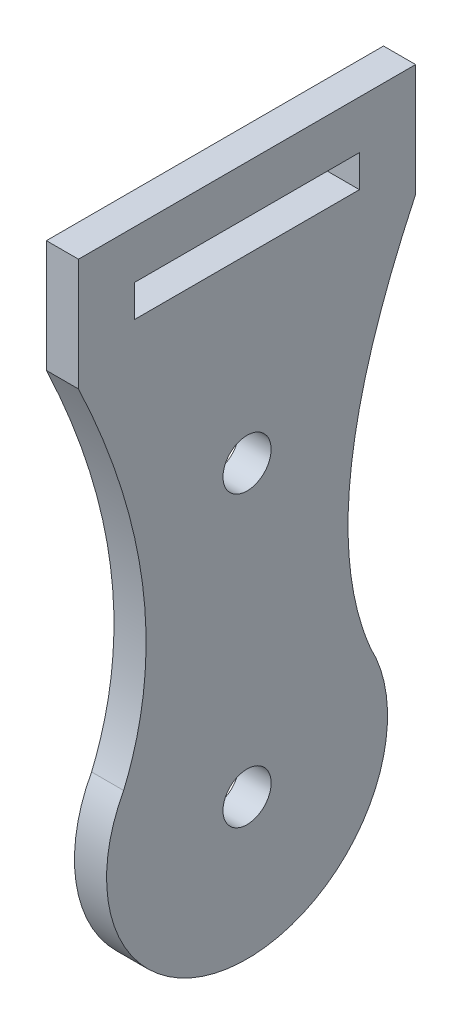
ISO-10303-21;
HEADER;
FILE_DESCRIPTION(('STEP AP214'),'2;1');
FILE_NAME('part.step','',(''),(''),'','','');
FILE_SCHEMA(('AUTOMOTIVE_DESIGN { 1 0 10303 214 1 1 1 1 }'));
ENDSEC;
DATA;
#1=APPLICATION_CONTEXT('core data for automotive mechanical design processes');
#2=APPLICATION_PROTOCOL_DEFINITION('international standard','automotive_design',2000,#1);
#3=PRODUCT_CONTEXT('',#1,'mechanical');
#4=PRODUCT('Part','Part','',(#3));
#5=PRODUCT_RELATED_PRODUCT_CATEGORY('part','',(#4));
#6=PRODUCT_DEFINITION_FORMATION('','',#4);
#7=PRODUCT_DEFINITION_CONTEXT('part definition',#1,'design');
#8=PRODUCT_DEFINITION('design','',#6,#7);
#9=PRODUCT_DEFINITION_SHAPE('','',#8);
#10=(LENGTH_UNIT() NAMED_UNIT(*) SI_UNIT(.MILLI.,.METRE.));
#11=(NAMED_UNIT(*) PLANE_ANGLE_UNIT() SI_UNIT($,.RADIAN.));
#12=(NAMED_UNIT(*) SI_UNIT($,.STERADIAN.) SOLID_ANGLE_UNIT());
#13=UNCERTAINTY_MEASURE_WITH_UNIT(LENGTH_MEASURE(1.E-05),#10,'distance_accuracy_value','');
#14=(GEOMETRIC_REPRESENTATION_CONTEXT(3) GLOBAL_UNCERTAINTY_ASSIGNED_CONTEXT((#13)) GLOBAL_UNIT_ASSIGNED_CONTEXT((#10,
#11,#12)) REPRESENTATION_CONTEXT('',''));
#15=CARTESIAN_POINT('',(0.,0.,0.));
#16=DIRECTION('',(0.,0.,1.));
#17=DIRECTION('',(1.,0.,0.));
#18=AXIS2_PLACEMENT_3D('',#15,#16,#17);
#19=CARTESIAN_POINT('',(2.,27.25,10.5));
#20=CARTESIAN_POINT('',(2.,13.2513662512649,3.86504806560417));
#21=CARTESIAN_POINT('',(2.,4.18403707499627,7.68481188807225));
#22=B_SPLINE_CURVE_WITH_KNOTS('',2,(#19,#20,#21),.UNSPECIFIED.,.F.,.F.,(3,3),(0.,
0.912495845409906),.UNSPECIFIED.);
#23=DIRECTION('',(-1.,0.,0.));
#24=VECTOR('',#23,1.);
#25=SURFACE_OF_LINEAR_EXTRUSION('',#22,#24);
#26=CARTESIAN_POINT('',(0.,27.25,10.5));
#27=CARTESIAN_POINT('',(0.,13.2513662512649,3.86504806560417));
#28=CARTESIAN_POINT('',(0.,4.18403707499627,7.68481188807225));
#29=B_SPLINE_CURVE_WITH_KNOTS('',2,(#26,#27,#28),.UNSPECIFIED.,.F.,.F.,(3,3),(0.,
0.912495845409906),.UNSPECIFIED.);
#30=CARTESIAN_POINT('',(0.,27.25,10.5));
#31=VERTEX_POINT('',#30);
#32=CARTESIAN_POINT('',(0.,4.18403707499627,7.68481188807225));
#33=VERTEX_POINT('',#32);
#34=EDGE_CURVE('E204',#31,#33,#29,.T.);
#35=ORIENTED_EDGE('',*,*,#34,.T.);
#36=DIRECTION('',(-1.,0.,0.));
#37=VECTOR('',#36,1.);
#38=CARTESIAN_POINT('',(2.,4.18403707499627,7.68481188807225));
#39=LINE('',#38,#37);
#40=CARTESIAN_POINT('',(2.,4.18403707499627,7.68481188807225));
#41=VERTEX_POINT('',#40);
#42=EDGE_CURVE('E11',#41,#33,#39,.T.);
#43=ORIENTED_EDGE('',*,*,#42,.F.);
#44=CARTESIAN_POINT('',(2.,27.25,10.5));
#45=VERTEX_POINT('',#44);
#46=EDGE_CURVE('E222',#45,#41,#22,.T.);
#47=ORIENTED_EDGE('',*,*,#46,.F.);
#48=DIRECTION('',(-1.,0.,0.));
#49=VECTOR('',#48,1.);
#50=CARTESIAN_POINT('',(2.,27.25,10.5));
#51=LINE('',#50,#49);
#52=EDGE_CURVE('E238',#45,#31,#51,.T.);
#53=ORIENTED_EDGE('',*,*,#52,.T.);
#54=EDGE_LOOP('',(#35,#43,#47,#53));
#55=FACE_BOUND('',#54,.T.);
#56=ADVANCED_FACE('F36',(#55),#25,.F.);
#57=CARTESIAN_POINT('',(2.,0.,0.));
#58=DIRECTION('',(-1.,0.,0.));
#59=DIRECTION('',(0.,0.,1.));
#60=AXIS2_PLACEMENT_3D('',#57,#58,#59);
#61=CYLINDRICAL_SURFACE('',#60,8.75);
#62=CARTESIAN_POINT('',(0.,0.,0.));
#63=DIRECTION('',(1.,0.,0.));
#64=DIRECTION('',(0.,0.,-1.));
#65=AXIS2_PLACEMENT_3D('',#62,#63,#64);
#66=CIRCLE('',#65,8.75);
#67=CARTESIAN_POINT('',(0.,4.18403707499627,-7.68481188807225));
#68=VERTEX_POINT('',#67);
#69=EDGE_CURVE('E196',#33,#68,#66,.T.);
#70=ORIENTED_EDGE('',*,*,#69,.T.);
#71=DIRECTION('',(-1.,0.,0.));
#72=VECTOR('',#71,1.);
#73=CARTESIAN_POINT('',(2.,4.18403707499627,-7.68481188807225));
#74=LINE('',#73,#72);
#75=CARTESIAN_POINT('',(2.,4.18403707499627,-7.68481188807225));
#76=VERTEX_POINT('',#75);
#77=EDGE_CURVE('E198',#76,#68,#74,.T.);
#78=ORIENTED_EDGE('',*,*,#77,.F.);
#79=CARTESIAN_POINT('',(2.,0.,0.));
#80=DIRECTION('',(1.,0.,0.));
#81=DIRECTION('',(0.,0.,-1.));
#82=AXIS2_PLACEMENT_3D('',#79,#80,#81);
#83=CIRCLE('',#82,8.75);
#84=EDGE_CURVE('E228',#41,#76,#83,.T.);
#85=ORIENTED_EDGE('',*,*,#84,.F.);
#86=ORIENTED_EDGE('',*,*,#42,.T.);
#87=EDGE_LOOP('',(#70,#78,#85,#86));
#88=FACE_BOUND('',#87,.T.);
#89=ADVANCED_FACE('F187',(#88),#61,.T.);
#90=CARTESIAN_POINT('',(2.,34.25,10.5));
#91=DIRECTION('',(0.,-1.,0.));
#92=DIRECTION('',(0.,0.,-1.));
#93=AXIS2_PLACEMENT_3D('',#90,#91,#92);
#94=PLANE('',#93);
#95=DIRECTION('',(0.,0.,1.));
#96=VECTOR('',#95,1.);
#97=CARTESIAN_POINT('',(0.,34.25,10.5));
#98=LINE('',#97,#96);
#99=CARTESIAN_POINT('',(0.,34.25,-10.5));
#100=VERTEX_POINT('',#99);
#101=CARTESIAN_POINT('',(0.,34.25,10.5));
#102=VERTEX_POINT('',#101);
#103=EDGE_CURVE('E203',#100,#102,#98,.T.);
#104=ORIENTED_EDGE('',*,*,#103,.T.);
#105=DIRECTION('',(-1.,0.,0.));
#106=VECTOR('',#105,1.);
#107=CARTESIAN_POINT('',(2.,34.25,10.5));
#108=LINE('',#107,#106);
#109=CARTESIAN_POINT('',(2.,34.25,10.5));
#110=VERTEX_POINT('',#109);
#111=EDGE_CURVE('E44',#110,#102,#108,.T.);
#112=ORIENTED_EDGE('',*,*,#111,.F.);
#113=DIRECTION('',(0.,0.,1.));
#114=VECTOR('',#113,1.);
#115=CARTESIAN_POINT('',(2.,34.25,10.5));
#116=LINE('',#115,#114);
#117=CARTESIAN_POINT('',(2.,34.25,-10.5));
#118=VERTEX_POINT('',#117);
#119=EDGE_CURVE('E234',#118,#110,#116,.T.);
#120=ORIENTED_EDGE('',*,*,#119,.F.);
#121=DIRECTION('',(-1.,0.,0.));
#122=VECTOR('',#121,1.);
#123=CARTESIAN_POINT('',(2.,34.25,-10.5));
#124=LINE('',#123,#122);
#125=EDGE_CURVE('E209',#118,#100,#124,.T.);
#126=ORIENTED_EDGE('',*,*,#125,.T.);
#127=EDGE_LOOP('',(#104,#112,#120,#126));
#128=FACE_BOUND('',#127,.T.);
#129=ADVANCED_FACE('F184',(#128),#94,.F.);
#130=CARTESIAN_POINT('',(2.,34.25,10.5));
#131=DIRECTION('',(0.,0.,-1.));
#132=DIRECTION('',(0.,1.,0.));
#133=AXIS2_PLACEMENT_3D('',#130,#131,#132);
#134=PLANE('',#133);
#135=DIRECTION('',(0.,-1.,0.));
#136=VECTOR('',#135,1.);
#137=CARTESIAN_POINT('',(0.,34.25,10.5));
#138=LINE('',#137,#136);
#139=EDGE_CURVE('E229',#102,#31,#138,.T.);
#140=ORIENTED_EDGE('',*,*,#139,.T.);
#141=ORIENTED_EDGE('',*,*,#52,.F.);
#142=DIRECTION('',(0.,-1.,0.));
#143=VECTOR('',#142,1.);
#144=CARTESIAN_POINT('',(2.,34.25,10.5));
#145=LINE('',#144,#143);
#146=EDGE_CURVE('E236',#110,#45,#145,.T.);
#147=ORIENTED_EDGE('',*,*,#146,.F.);
#148=ORIENTED_EDGE('',*,*,#111,.T.);
#149=EDGE_LOOP('',(#140,#141,#147,#148));
#150=FACE_BOUND('',#149,.T.);
#151=ADVANCED_FACE('F177',(#150),#134,.F.);
#152=CARTESIAN_POINT('',(2.,14.4841923943815,6.47872700482015));
#153=DIRECTION('',(1.,0.,0.));
#154=DIRECTION('',(0.,0.,-1.));
#155=AXIS2_PLACEMENT_3D('',#152,#153,#154);
#156=PLANE('',#155);
#157=CARTESIAN_POINT('',(2.,0.,0.));
#158=DIRECTION('',(1.,0.,0.));
#159=DIRECTION('',(0.,0.,-1.));
#160=AXIS2_PLACEMENT_3D('',#157,#158,#159);
#161=CIRCLE('',#160,1.5);
#162=CARTESIAN_POINT('',(2.,0.,-1.5));
#163=VERTEX_POINT('',#162);
#164=EDGE_CURVE('E290',#163,#163,#161,.T.);
#165=ORIENTED_EDGE('',*,*,#164,.F.);
#166=EDGE_LOOP('',(#165));
#167=FACE_BOUND('',#166,.T.);
#168=CARTESIAN_POINT('',(2.,18.,0.));
#169=DIRECTION('',(1.,0.,0.));
#170=DIRECTION('',(0.,0.,-1.));
#171=AXIS2_PLACEMENT_3D('',#168,#169,#170);
#172=CIRCLE('',#171,1.5);
#173=CARTESIAN_POINT('',(2.,18.,-1.5));
#174=VERTEX_POINT('',#173);
#175=EDGE_CURVE('E137',#174,#174,#172,.T.);
#176=ORIENTED_EDGE('',*,*,#175,.F.);
#177=EDGE_LOOP('',(#176));
#178=FACE_BOUND('',#177,.T.);
#179=DIRECTION('',(0.,1.,0.));
#180=VECTOR('',#179,1.);
#181=CARTESIAN_POINT('',(2.,31.25,-7.));
#182=LINE('',#181,#180);
#183=CARTESIAN_POINT('',(2.,29.25,-7.));
#184=VERTEX_POINT('',#183);
#185=CARTESIAN_POINT('',(2.,31.25,-7.));
#186=VERTEX_POINT('',#185);
#187=EDGE_CURVE('E51',#184,#186,#182,.T.);
#188=ORIENTED_EDGE('',*,*,#187,.F.);
#189=DIRECTION('',(0.,0.,-1.));
#190=VECTOR('',#189,1.);
#191=CARTESIAN_POINT('',(2.,29.25,7.));
#192=LINE('',#191,#190);
#193=CARTESIAN_POINT('',(2.,29.25,7.));
#194=VERTEX_POINT('',#193);
#195=EDGE_CURVE('E131',#194,#184,#192,.T.);
#196=ORIENTED_EDGE('',*,*,#195,.F.);
#197=DIRECTION('',(0.,-1.,0.));
#198=VECTOR('',#197,1.);
#199=CARTESIAN_POINT('',(2.,31.25,7.));
#200=LINE('',#199,#198);
#201=CARTESIAN_POINT('',(2.,31.25,7.));
#202=VERTEX_POINT('',#201);
#203=EDGE_CURVE('E134',#202,#194,#200,.T.);
#204=ORIENTED_EDGE('',*,*,#203,.F.);
#205=DIRECTION('',(0.,0.,1.));
#206=VECTOR('',#205,1.);
#207=CARTESIAN_POINT('',(2.,31.25,7.));
#208=LINE('',#207,#206);
#209=EDGE_CURVE('E143',#186,#202,#208,.T.);
#210=ORIENTED_EDGE('',*,*,#209,.F.);
#211=EDGE_LOOP('',(#188,#196,#204,#210));
#212=FACE_BOUND('',#211,.T.);
#213=ORIENTED_EDGE('',*,*,#46,.T.);
#214=ORIENTED_EDGE('',*,*,#84,.T.);
#215=CARTESIAN_POINT('',(2.,27.25,-10.5));
#216=CARTESIAN_POINT('',(2.,13.2513662512649,-3.86504806560417));
#217=CARTESIAN_POINT('',(2.,4.18403707499627,-7.68481188807225));
#218=B_SPLINE_CURVE_WITH_KNOTS('',2,(#215,#216,#217),.UNSPECIFIED.,.F.,.F.,(3,3),(0.,
0.912495845409906),.UNSPECIFIED.);
#219=CARTESIAN_POINT('',(2.,27.25,-10.5));
#220=VERTEX_POINT('',#219);
#221=EDGE_CURVE('E154',#220,#76,#218,.T.);
#222=ORIENTED_EDGE('',*,*,#221,.F.);
#223=DIRECTION('',(0.,-1.,0.));
#224=VECTOR('',#223,1.);
#225=CARTESIAN_POINT('',(2.,34.25,-10.5));
#226=LINE('',#225,#224);
#227=EDGE_CURVE('E160',#118,#220,#226,.T.);
#228=ORIENTED_EDGE('',*,*,#227,.F.);
#229=ORIENTED_EDGE('',*,*,#119,.T.);
#230=ORIENTED_EDGE('',*,*,#146,.T.);
#231=EDGE_LOOP('',(#213,#214,#222,#228,#229,#230));
#232=FACE_BOUND('',#231,.T.);
#233=ADVANCED_FACE('F174',(#167,#178,#212,#232),#156,.T.);
#234=CARTESIAN_POINT('',(0.,14.4841923943815,6.47872700482015));
#235=DIRECTION('',(1.,0.,0.));
#236=DIRECTION('',(0.,0.,-1.));
#237=AXIS2_PLACEMENT_3D('',#234,#235,#236);
#238=PLANE('',#237);
#239=CARTESIAN_POINT('',(0.,0.,0.));
#240=DIRECTION('',(1.,0.,0.));
#241=DIRECTION('',(0.,0.,-1.));
#242=AXIS2_PLACEMENT_3D('',#239,#240,#241);
#243=CIRCLE('',#242,1.5);
#244=CARTESIAN_POINT('',(0.,0.,-1.5));
#245=VERTEX_POINT('',#244);
#246=EDGE_CURVE('E287',#245,#245,#243,.T.);
#247=ORIENTED_EDGE('',*,*,#246,.T.);
#248=EDGE_LOOP('',(#247));
#249=FACE_BOUND('',#248,.T.);
#250=CARTESIAN_POINT('',(0.,18.,0.));
#251=DIRECTION('',(1.,0.,0.));
#252=DIRECTION('',(0.,0.,-1.));
#253=AXIS2_PLACEMENT_3D('',#250,#251,#252);
#254=CIRCLE('',#253,1.5);
#255=CARTESIAN_POINT('',(0.,18.,-1.5));
#256=VERTEX_POINT('',#255);
#257=EDGE_CURVE('E144',#256,#256,#254,.T.);
#258=ORIENTED_EDGE('',*,*,#257,.T.);
#259=EDGE_LOOP('',(#258));
#260=FACE_BOUND('',#259,.T.);
#261=DIRECTION('',(0.,0.,-1.));
#262=VECTOR('',#261,1.);
#263=CARTESIAN_POINT('',(0.,29.25,7.));
#264=LINE('',#263,#262);
#265=CARTESIAN_POINT('',(0.,29.25,7.));
#266=VERTEX_POINT('',#265);
#267=CARTESIAN_POINT('',(0.,29.25,-7.));
#268=VERTEX_POINT('',#267);
#269=EDGE_CURVE('E121',#266,#268,#264,.T.);
#270=ORIENTED_EDGE('',*,*,#269,.T.);
#271=DIRECTION('',(0.,1.,0.));
#272=VECTOR('',#271,1.);
#273=CARTESIAN_POINT('',(0.,31.25,-7.));
#274=LINE('',#273,#272);
#275=CARTESIAN_POINT('',(0.,31.25,-7.));
#276=VERTEX_POINT('',#275);
#277=EDGE_CURVE('E115',#268,#276,#274,.T.);
#278=ORIENTED_EDGE('',*,*,#277,.T.);
#279=DIRECTION('',(0.,0.,1.));
#280=VECTOR('',#279,1.);
#281=CARTESIAN_POINT('',(0.,31.25,7.));
#282=LINE('',#281,#280);
#283=CARTESIAN_POINT('',(0.,31.25,7.));
#284=VERTEX_POINT('',#283);
#285=EDGE_CURVE('E124',#276,#284,#282,.T.);
#286=ORIENTED_EDGE('',*,*,#285,.T.);
#287=DIRECTION('',(0.,-1.,0.));
#288=VECTOR('',#287,1.);
#289=CARTESIAN_POINT('',(0.,31.25,7.));
#290=LINE('',#289,#288);
#291=EDGE_CURVE('E59',#284,#266,#290,.T.);
#292=ORIENTED_EDGE('',*,*,#291,.T.);
#293=EDGE_LOOP('',(#270,#278,#286,#292));
#294=FACE_BOUND('',#293,.T.);
#295=ORIENTED_EDGE('',*,*,#34,.F.);
#296=ORIENTED_EDGE('',*,*,#139,.F.);
#297=ORIENTED_EDGE('',*,*,#103,.F.);
#298=DIRECTION('',(0.,-1.,0.));
#299=VECTOR('',#298,1.);
#300=CARTESIAN_POINT('',(0.,34.25,-10.5));
#301=LINE('',#300,#299);
#302=CARTESIAN_POINT('',(0.,27.25,-10.5));
#303=VERTEX_POINT('',#302);
#304=EDGE_CURVE('E161',#100,#303,#301,.T.);
#305=ORIENTED_EDGE('',*,*,#304,.T.);
#306=CARTESIAN_POINT('',(0.,27.25,-10.5));
#307=CARTESIAN_POINT('',(0.,13.2513662512649,-3.86504806560417));
#308=CARTESIAN_POINT('',(0.,4.18403707499627,-7.68481188807225));
#309=B_SPLINE_CURVE_WITH_KNOTS('',2,(#306,#307,#308),.UNSPECIFIED.,.F.,.F.,(3,3),(0.,
0.912495845409906),.UNSPECIFIED.);
#310=EDGE_CURVE('E150',#303,#68,#309,.T.);
#311=ORIENTED_EDGE('',*,*,#310,.T.);
#312=ORIENTED_EDGE('',*,*,#69,.F.);
#313=EDGE_LOOP('',(#295,#296,#297,#305,#311,#312));
#314=FACE_BOUND('',#313,.T.);
#315=ADVANCED_FACE('F128',(#249,#260,#294,#314),#238,.F.);
#316=DIRECTION('',(-1.,0.,0.));
#317=VECTOR('',#316,1.);
#318=SURFACE_OF_LINEAR_EXTRUSION('',#218,#317);
#319=ORIENTED_EDGE('',*,*,#310,.F.);
#320=DIRECTION('',(-1.,0.,0.));
#321=VECTOR('',#320,1.);
#322=CARTESIAN_POINT('',(2.,27.25,-10.5));
#323=LINE('',#322,#321);
#324=EDGE_CURVE('E221',#220,#303,#323,.T.);
#325=ORIENTED_EDGE('',*,*,#324,.F.);
#326=ORIENTED_EDGE('',*,*,#221,.T.);
#327=ORIENTED_EDGE('',*,*,#77,.T.);
#328=EDGE_LOOP('',(#319,#325,#326,#327));
#329=FACE_BOUND('',#328,.T.);
#330=ADVANCED_FACE('F167',(#329),#318,.T.);
#331=CARTESIAN_POINT('',(2.,34.25,-10.5));
#332=DIRECTION('',(0.,0.,-1.));
#333=DIRECTION('',(0.,1.,0.));
#334=AXIS2_PLACEMENT_3D('',#331,#332,#333);
#335=PLANE('',#334);
#336=ORIENTED_EDGE('',*,*,#304,.F.);
#337=ORIENTED_EDGE('',*,*,#125,.F.);
#338=ORIENTED_EDGE('',*,*,#227,.T.);
#339=ORIENTED_EDGE('',*,*,#324,.T.);
#340=EDGE_LOOP('',(#336,#337,#338,#339));
#341=FACE_BOUND('',#340,.T.);
#342=ADVANCED_FACE('F171',(#341),#335,.T.);
#343=CARTESIAN_POINT('',(0.,31.25,-7.));
#344=DIRECTION('',(0.,0.,-1.));
#345=DIRECTION('',(-1.,0.,0.));
#346=AXIS2_PLACEMENT_3D('',#343,#344,#345);
#347=PLANE('',#346);
#348=ORIENTED_EDGE('',*,*,#187,.T.);
#349=DIRECTION('',(1.,0.,0.));
#350=VECTOR('',#349,1.);
#351=CARTESIAN_POINT('',(0.,31.25,-7.));
#352=LINE('',#351,#350);
#353=EDGE_CURVE('E111',#276,#186,#352,.T.);
#354=ORIENTED_EDGE('',*,*,#353,.F.);
#355=ORIENTED_EDGE('',*,*,#277,.F.);
#356=DIRECTION('',(1.,0.,0.));
#357=VECTOR('',#356,1.);
#358=CARTESIAN_POINT('',(0.,29.25,-7.));
#359=LINE('',#358,#357);
#360=EDGE_CURVE('E148',#268,#184,#359,.T.);
#361=ORIENTED_EDGE('',*,*,#360,.T.);
#362=EDGE_LOOP('',(#348,#354,#355,#361));
#363=FACE_BOUND('',#362,.T.);
#364=ADVANCED_FACE('F113',(#363),#347,.F.);
#365=CARTESIAN_POINT('',(0.,29.25,7.));
#366=DIRECTION('',(0.,-1.,0.));
#367=DIRECTION('',(0.,0.,-1.));
#368=AXIS2_PLACEMENT_3D('',#365,#366,#367);
#369=PLANE('',#368);
#370=ORIENTED_EDGE('',*,*,#195,.T.);
#371=ORIENTED_EDGE('',*,*,#360,.F.);
#372=ORIENTED_EDGE('',*,*,#269,.F.);
#373=DIRECTION('',(1.,0.,0.));
#374=VECTOR('',#373,1.);
#375=CARTESIAN_POINT('',(0.,29.25,7.));
#376=LINE('',#375,#374);
#377=EDGE_CURVE('E151',#266,#194,#376,.T.);
#378=ORIENTED_EDGE('',*,*,#377,.T.);
#379=EDGE_LOOP('',(#370,#371,#372,#378));
#380=FACE_BOUND('',#379,.T.);
#381=ADVANCED_FACE('F263',(#380),#369,.F.);
#382=CARTESIAN_POINT('',(0.,31.25,7.));
#383=DIRECTION('',(0.,0.,1.));
#384=DIRECTION('',(1.,0.,0.));
#385=AXIS2_PLACEMENT_3D('',#382,#383,#384);
#386=PLANE('',#385);
#387=ORIENTED_EDGE('',*,*,#203,.T.);
#388=ORIENTED_EDGE('',*,*,#377,.F.);
#389=ORIENTED_EDGE('',*,*,#291,.F.);
#390=DIRECTION('',(1.,0.,0.));
#391=VECTOR('',#390,1.);
#392=CARTESIAN_POINT('',(0.,31.25,7.));
#393=LINE('',#392,#391);
#394=EDGE_CURVE('E120',#284,#202,#393,.T.);
#395=ORIENTED_EDGE('',*,*,#394,.T.);
#396=EDGE_LOOP('',(#387,#388,#389,#395));
#397=FACE_BOUND('',#396,.T.);
#398=ADVANCED_FACE('F267',(#397),#386,.F.);
#399=CARTESIAN_POINT('',(0.,31.25,7.));
#400=DIRECTION('',(0.,1.,0.));
#401=DIRECTION('',(0.,0.,1.));
#402=AXIS2_PLACEMENT_3D('',#399,#400,#401);
#403=PLANE('',#402);
#404=ORIENTED_EDGE('',*,*,#209,.T.);
#405=ORIENTED_EDGE('',*,*,#394,.F.);
#406=ORIENTED_EDGE('',*,*,#285,.F.);
#407=ORIENTED_EDGE('',*,*,#353,.T.);
#408=EDGE_LOOP('',(#404,#405,#406,#407));
#409=FACE_BOUND('',#408,.T.);
#410=ADVANCED_FACE('F125',(#409),#403,.F.);
#411=CARTESIAN_POINT('',(0.,18.,0.));
#412=DIRECTION('',(1.,0.,0.));
#413=DIRECTION('',(0.,0.,-1.));
#414=AXIS2_PLACEMENT_3D('',#411,#412,#413);
#415=CYLINDRICAL_SURFACE('',#414,1.5);
#416=ORIENTED_EDGE('',*,*,#257,.F.);
#417=EDGE_LOOP('',(#416));
#418=FACE_BOUND('',#417,.T.);
#419=ORIENTED_EDGE('',*,*,#175,.T.);
#420=EDGE_LOOP('',(#419));
#421=FACE_BOUND('',#420,.T.);
#422=ADVANCED_FACE('F273',(#418,#421),#415,.F.);
#423=CARTESIAN_POINT('',(0.,0.,0.));
#424=DIRECTION('',(1.,0.,0.));
#425=DIRECTION('',(0.,0.,-1.));
#426=AXIS2_PLACEMENT_3D('',#423,#424,#425);
#427=CYLINDRICAL_SURFACE('',#426,1.5);
#428=ORIENTED_EDGE('',*,*,#246,.F.);
#429=EDGE_LOOP('',(#428));
#430=FACE_BOUND('',#429,.T.);
#431=ORIENTED_EDGE('',*,*,#164,.T.);
#432=EDGE_LOOP('',(#431));
#433=FACE_BOUND('',#432,.T.);
#434=ADVANCED_FACE('F278',(#430,#433),#427,.F.);
#435=CLOSED_SHELL('',(#56,#89,#129,#151,#233,#315,#330,#342,#364,#381,#398,#410,#422,#434));
#436=MANIFOLD_SOLID_BREP('B2',#435);
#437=ADVANCED_BREP_SHAPE_REPRESENTATION('',(#18,#436),#14);
#438=SHAPE_DEFINITION_REPRESENTATION(#9,#437);
ENDSEC;
END-ISO-10303-21;
